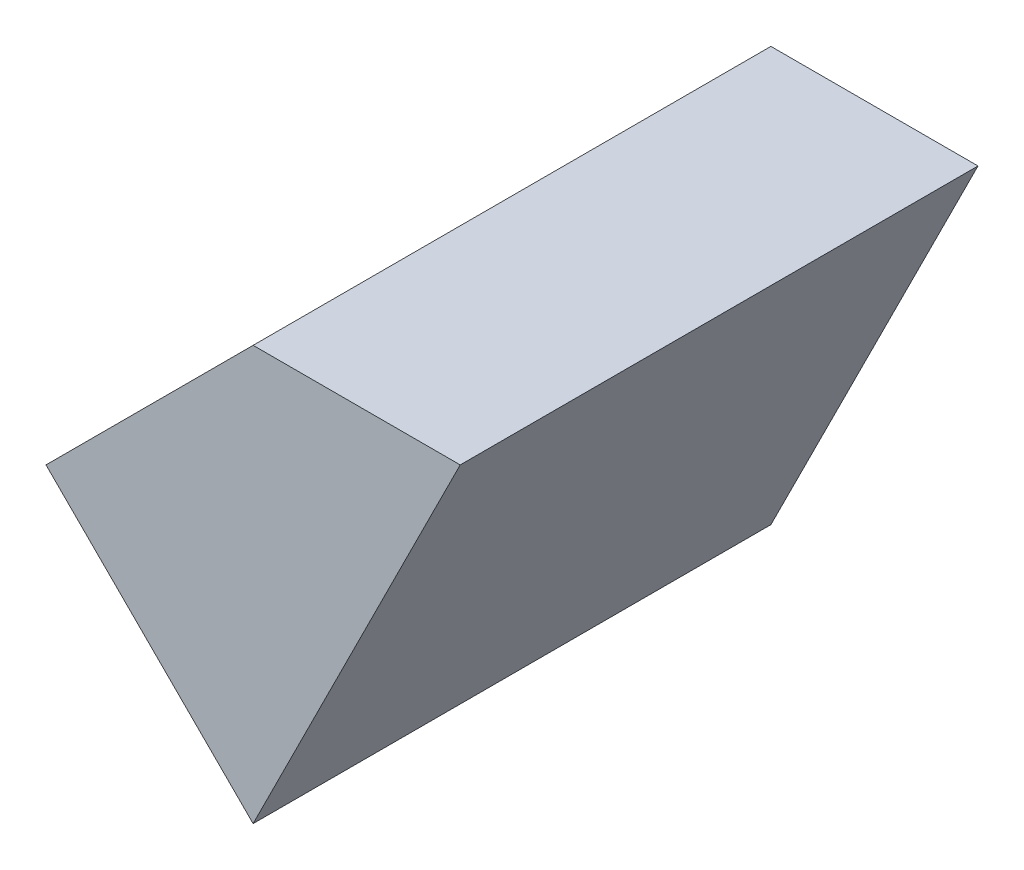
ISO-10303-21;
HEADER;
FILE_DESCRIPTION(('STEP AP214'),'2;1');
FILE_NAME('part.step','',(''),(''),'','','');
FILE_SCHEMA(('AUTOMOTIVE_DESIGN { 1 0 10303 214 1 1 1 1 }'));
ENDSEC;
DATA;
#1=APPLICATION_CONTEXT('core data for automotive mechanical design processes');
#2=APPLICATION_PROTOCOL_DEFINITION('international standard','automotive_design',2000,#1);
#3=PRODUCT_CONTEXT('',#1,'mechanical');
#4=PRODUCT('Part','Part','',(#3));
#5=PRODUCT_RELATED_PRODUCT_CATEGORY('part','',(#4));
#6=PRODUCT_DEFINITION_FORMATION('','',#4);
#7=PRODUCT_DEFINITION_CONTEXT('part definition',#1,'design');
#8=PRODUCT_DEFINITION('design','',#6,#7);
#9=PRODUCT_DEFINITION_SHAPE('','',#8);
#10=(LENGTH_UNIT() NAMED_UNIT(*) SI_UNIT(.MILLI.,.METRE.));
#11=(NAMED_UNIT(*) PLANE_ANGLE_UNIT() SI_UNIT($,.RADIAN.));
#12=(NAMED_UNIT(*) SI_UNIT($,.STERADIAN.) SOLID_ANGLE_UNIT());
#13=UNCERTAINTY_MEASURE_WITH_UNIT(LENGTH_MEASURE(1.E-05),#10,'distance_accuracy_value','');
#14=(GEOMETRIC_REPRESENTATION_CONTEXT(3) GLOBAL_UNCERTAINTY_ASSIGNED_CONTEXT((#13)) GLOBAL_UNIT_ASSIGNED_CONTEXT((#10,
#11,#12)) REPRESENTATION_CONTEXT('',''));
#15=CARTESIAN_POINT('',(0.,0.,0.));
#16=DIRECTION('',(0.,0.,1.));
#17=DIRECTION('',(1.,0.,0.));
#18=AXIS2_PLACEMENT_3D('',#15,#16,#17);
#19=CARTESIAN_POINT('',(-10.,-10.,25.));
#20=DIRECTION('',(0.707106781186548,-0.707106781186547,0.));
#21=DIRECTION('',(0.707106781186547,0.707106781186548,0.));
#22=AXIS2_PLACEMENT_3D('',#19,#20,#21);
#23=PLANE('',#22);
#24=DIRECTION('',(-0.707106781186547,-0.707106781186548,0.));
#25=VECTOR('',#24,1.);
#26=CARTESIAN_POINT('',(-10.,-10.,0.));
#27=LINE('',#26,#25);
#28=CARTESIAN_POINT('',(0.,0.,0.));
#29=VERTEX_POINT('',#28);
#30=CARTESIAN_POINT('',(-10.,-10.,0.));
#31=VERTEX_POINT('',#30);
#32=EDGE_CURVE('E96',#29,#31,#27,.T.);
#33=ORIENTED_EDGE('',*,*,#32,.T.);
#34=DIRECTION('',(0.,0.,-1.));
#35=VECTOR('',#34,1.);
#36=CARTESIAN_POINT('',(-10.,-10.,25.));
#37=LINE('',#36,#35);
#38=CARTESIAN_POINT('',(-10.,-10.,25.));
#39=VERTEX_POINT('',#38);
#40=EDGE_CURVE('E11',#39,#31,#37,.T.);
#41=ORIENTED_EDGE('',*,*,#40,.F.);
#42=DIRECTION('',(-0.707106781186547,-0.707106781186548,0.));
#43=VECTOR('',#42,1.);
#44=CARTESIAN_POINT('',(-10.,-10.,25.));
#45=LINE('',#44,#43);
#46=CARTESIAN_POINT('',(0.,0.,25.));
#47=VERTEX_POINT('',#46);
#48=EDGE_CURVE('E84',#47,#39,#45,.T.);
#49=ORIENTED_EDGE('',*,*,#48,.F.);
#50=DIRECTION('',(0.,0.,-1.));
#51=VECTOR('',#50,1.);
#52=CARTESIAN_POINT('',(0.,0.,25.));
#53=LINE('',#52,#51);
#54=EDGE_CURVE('E92',#47,#29,#53,.T.);
#55=ORIENTED_EDGE('',*,*,#54,.T.);
#56=EDGE_LOOP('',(#33,#41,#49,#55));
#57=FACE_BOUND('',#56,.T.);
#58=ADVANCED_FACE('F33',(#57),#23,.F.);
#59=CARTESIAN_POINT('',(0.,-20.,25.));
#60=DIRECTION('',(0.707106781186548,0.707106781186548,0.));
#61=DIRECTION('',(-0.707106781186548,0.707106781186548,0.));
#62=AXIS2_PLACEMENT_3D('',#59,#60,#61);
#63=PLANE('',#62);
#64=DIRECTION('',(0.707106781186548,-0.707106781186548,0.));
#65=VECTOR('',#64,1.);
#66=CARTESIAN_POINT('',(0.,-20.,0.));
#67=LINE('',#66,#65);
#68=CARTESIAN_POINT('',(0.,-20.,0.));
#69=VERTEX_POINT('',#68);
#70=EDGE_CURVE('E88',#31,#69,#67,.T.);
#71=ORIENTED_EDGE('',*,*,#70,.T.);
#72=DIRECTION('',(0.,0.,-1.));
#73=VECTOR('',#72,1.);
#74=CARTESIAN_POINT('',(0.,-20.,25.));
#75=LINE('',#74,#73);
#76=CARTESIAN_POINT('',(0.,-20.,25.));
#77=VERTEX_POINT('',#76);
#78=EDGE_CURVE('E41',#77,#69,#75,.T.);
#79=ORIENTED_EDGE('',*,*,#78,.F.);
#80=DIRECTION('',(0.707106781186548,-0.707106781186548,0.));
#81=VECTOR('',#80,1.);
#82=CARTESIAN_POINT('',(0.,-20.,25.));
#83=LINE('',#82,#81);
#84=EDGE_CURVE('E79',#39,#77,#83,.T.);
#85=ORIENTED_EDGE('',*,*,#84,.F.);
#86=ORIENTED_EDGE('',*,*,#40,.T.);
#87=EDGE_LOOP('',(#71,#79,#85,#86));
#88=FACE_BOUND('',#87,.T.);
#89=ADVANCED_FACE('F87',(#88),#63,.F.);
#90=CARTESIAN_POINT('',(10.,0.,25.));
#91=DIRECTION('',(-0.894427190999916,0.447213595499958,0.));
#92=DIRECTION('',(-0.447213595499958,-0.894427190999916,0.));
#93=AXIS2_PLACEMENT_3D('',#90,#91,#92);
#94=PLANE('',#93);
#95=DIRECTION('',(0.447213595499958,0.894427190999916,0.));
#96=VECTOR('',#95,1.);
#97=CARTESIAN_POINT('',(10.,0.,0.));
#98=LINE('',#97,#96);
#99=CARTESIAN_POINT('',(10.,0.,0.));
#100=VERTEX_POINT('',#99);
#101=EDGE_CURVE('E66',#69,#100,#98,.T.);
#102=ORIENTED_EDGE('',*,*,#101,.T.);
#103=DIRECTION('',(0.,0.,-1.));
#104=VECTOR('',#103,1.);
#105=CARTESIAN_POINT('',(10.,0.,25.));
#106=LINE('',#105,#104);
#107=CARTESIAN_POINT('',(10.,0.,25.));
#108=VERTEX_POINT('',#107);
#109=EDGE_CURVE('E89',#108,#100,#106,.T.);
#110=ORIENTED_EDGE('',*,*,#109,.F.);
#111=DIRECTION('',(0.447213595499958,0.894427190999916,0.));
#112=VECTOR('',#111,1.);
#113=CARTESIAN_POINT('',(10.,0.,25.));
#114=LINE('',#113,#112);
#115=EDGE_CURVE('E82',#77,#108,#114,.T.);
#116=ORIENTED_EDGE('',*,*,#115,.F.);
#117=ORIENTED_EDGE('',*,*,#78,.T.);
#118=EDGE_LOOP('',(#102,#110,#116,#117));
#119=FACE_BOUND('',#118,.T.);
#120=ADVANCED_FACE('F90',(#119),#94,.F.);
#121=CARTESIAN_POINT('',(0.,0.,25.));
#122=DIRECTION('',(0.,-1.,0.));
#123=DIRECTION('',(0.,0.,-1.));
#124=AXIS2_PLACEMENT_3D('',#121,#122,#123);
#125=PLANE('',#124);
#126=DIRECTION('',(-1.,0.,0.));
#127=VECTOR('',#126,1.);
#128=CARTESIAN_POINT('',(0.,0.,0.));
#129=LINE('',#128,#127);
#130=EDGE_CURVE('E72',#100,#29,#129,.T.);
#131=ORIENTED_EDGE('',*,*,#130,.T.);
#132=ORIENTED_EDGE('',*,*,#54,.F.);
#133=DIRECTION('',(-1.,0.,0.));
#134=VECTOR('',#133,1.);
#135=CARTESIAN_POINT('',(0.,0.,25.));
#136=LINE('',#135,#134);
#137=EDGE_CURVE('E49',#108,#47,#136,.T.);
#138=ORIENTED_EDGE('',*,*,#137,.F.);
#139=ORIENTED_EDGE('',*,*,#109,.T.);
#140=EDGE_LOOP('',(#131,#132,#138,#139));
#141=FACE_BOUND('',#140,.T.);
#142=ADVANCED_FACE('F103',(#141),#125,.F.);
#143=CARTESIAN_POINT('',(0.,0.,25.));
#144=DIRECTION('',(0.,0.,1.));
#145=DIRECTION('',(1.,0.,0.));
#146=AXIS2_PLACEMENT_3D('',#143,#144,#145);
#147=PLANE('',#146);
#148=ORIENTED_EDGE('',*,*,#48,.T.);
#149=ORIENTED_EDGE('',*,*,#84,.T.);
#150=ORIENTED_EDGE('',*,*,#115,.T.);
#151=ORIENTED_EDGE('',*,*,#137,.T.);
#152=EDGE_LOOP('',(#148,#149,#150,#151));
#153=FACE_BOUND('',#152,.T.);
#154=ADVANCED_FACE('F80',(#153),#147,.T.);
#155=CARTESIAN_POINT('',(0.,0.,0.));
#156=DIRECTION('',(0.,0.,1.));
#157=DIRECTION('',(1.,0.,0.));
#158=AXIS2_PLACEMENT_3D('',#155,#156,#157);
#159=PLANE('',#158);
#160=ORIENTED_EDGE('',*,*,#32,.F.);
#161=ORIENTED_EDGE('',*,*,#130,.F.);
#162=ORIENTED_EDGE('',*,*,#101,.F.);
#163=ORIENTED_EDGE('',*,*,#70,.F.);
#164=EDGE_LOOP('',(#160,#161,#162,#163));
#165=FACE_BOUND('',#164,.T.);
#166=ADVANCED_FACE('F106',(#165),#159,.F.);
#167=CLOSED_SHELL('',(#58,#89,#120,#142,#154,#166));
#168=MANIFOLD_SOLID_BREP('B2',#167);
#169=ADVANCED_BREP_SHAPE_REPRESENTATION('',(#18,#168),#14);
#170=SHAPE_DEFINITION_REPRESENTATION(#9,#169);
ENDSEC;
END-ISO-10303-21;
